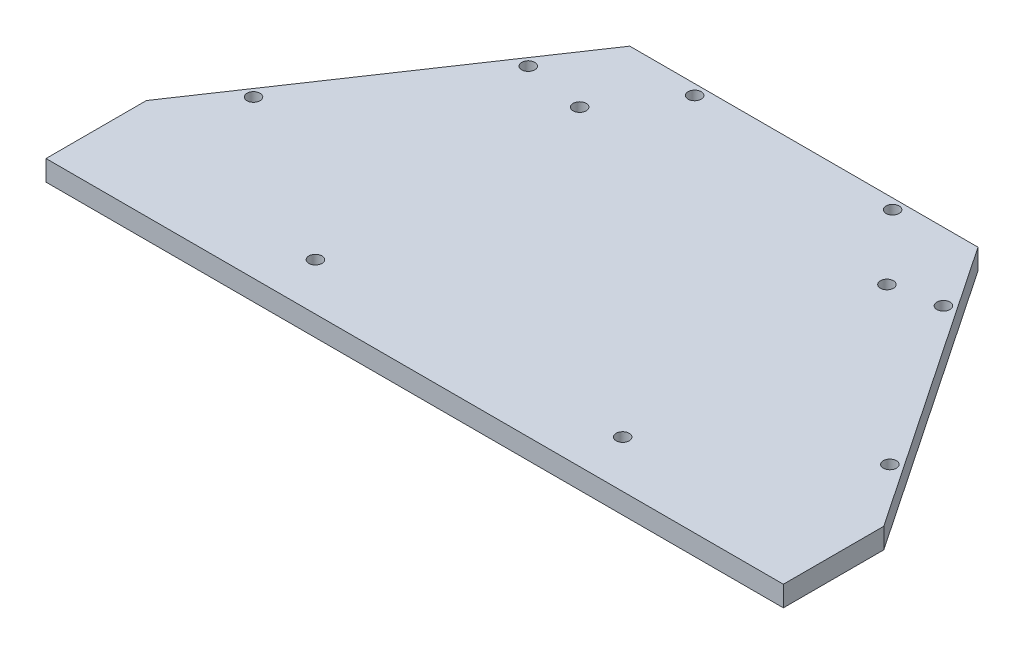
ISO-10303-21;
HEADER;
FILE_DESCRIPTION(('STEP AP214'),'2;1');
FILE_NAME('part.step','',(''),(''),'','','');
FILE_SCHEMA(('AUTOMOTIVE_DESIGN { 1 0 10303 214 1 1 1 1 }'));
ENDSEC;
DATA;
#1=APPLICATION_CONTEXT('core data for automotive mechanical design processes');
#2=APPLICATION_PROTOCOL_DEFINITION('international standard','automotive_design',2000,#1);
#3=PRODUCT_CONTEXT('',#1,'mechanical');
#4=PRODUCT('Part','Part','',(#3));
#5=PRODUCT_RELATED_PRODUCT_CATEGORY('part','',(#4));
#6=PRODUCT_DEFINITION_FORMATION('','',#4);
#7=PRODUCT_DEFINITION_CONTEXT('part definition',#1,'design');
#8=PRODUCT_DEFINITION('design','',#6,#7);
#9=PRODUCT_DEFINITION_SHAPE('','',#8);
#10=(LENGTH_UNIT() NAMED_UNIT(*) SI_UNIT(.MILLI.,.METRE.));
#11=(NAMED_UNIT(*) PLANE_ANGLE_UNIT() SI_UNIT($,.RADIAN.));
#12=(NAMED_UNIT(*) SI_UNIT($,.STERADIAN.) SOLID_ANGLE_UNIT());
#13=UNCERTAINTY_MEASURE_WITH_UNIT(LENGTH_MEASURE(1.E-05),#10,'distance_accuracy_value','');
#14=(GEOMETRIC_REPRESENTATION_CONTEXT(3) GLOBAL_UNCERTAINTY_ASSIGNED_CONTEXT((#13)) GLOBAL_UNIT_ASSIGNED_CONTEXT((#10,
#11,#12)) REPRESENTATION_CONTEXT('',''));
#15=CARTESIAN_POINT('',(0.,0.,0.));
#16=DIRECTION('',(0.,0.,1.));
#17=DIRECTION('',(1.,0.,0.));
#18=AXIS2_PLACEMENT_3D('',#15,#16,#17);
#19=CARTESIAN_POINT('',(41.5074305798119,-8.,-4.70896110099949));
#20=DIRECTION('',(0.,1.,0.));
#21=DIRECTION('',(0.,0.,1.));
#22=AXIS2_PLACEMENT_3D('',#19,#20,#21);
#23=CYLINDRICAL_SURFACE('',#22,1.60000000000001);
#24=CARTESIAN_POINT('',(41.5074305798119,5.,-4.70896110099949));
#25=DIRECTION('',(0.,1.,0.));
#26=DIRECTION('',(0.,0.,-1.));
#27=AXIS2_PLACEMENT_3D('',#24,#25,#26);
#28=CIRCLE('',#27,1.60000000000001);
#29=CARTESIAN_POINT('',(41.5074305798119,5.,-6.30896110099949));
#30=VERTEX_POINT('',#29);
#31=EDGE_CURVE('E203',#30,#30,#28,.T.);
#32=ORIENTED_EDGE('',*,*,#31,.T.);
#33=EDGE_LOOP('',(#32));
#34=FACE_BOUND('',#33,.T.);
#35=CARTESIAN_POINT('',(41.5074305798119,1.,-4.70896110099949));
#36=DIRECTION('',(0.,-1.,0.));
#37=DIRECTION('',(0.,0.,-1.));
#38=AXIS2_PLACEMENT_3D('',#35,#36,#37);
#39=CIRCLE('',#38,1.60000000000001);
#40=CARTESIAN_POINT('',(41.5074305798119,1.,-6.30896110099949));
#41=VERTEX_POINT('',#40);
#42=EDGE_CURVE('E42',#41,#41,#39,.F.);
#43=ORIENTED_EDGE('',*,*,#42,.F.);
#44=EDGE_LOOP('',(#43));
#45=FACE_BOUND('',#44,.T.);
#46=ADVANCED_FACE('F38',(#34,#45),#23,.F.);
#47=CARTESIAN_POINT('',(-33.4925694201881,-8.,-4.70896110099947));
#48=DIRECTION('',(0.,1.,0.));
#49=DIRECTION('',(0.,0.,1.));
#50=AXIS2_PLACEMENT_3D('',#47,#48,#49);
#51=CYLINDRICAL_SURFACE('',#50,1.60000000000001);
#52=CARTESIAN_POINT('',(-33.4925694201881,5.,-4.70896110099947));
#53=DIRECTION('',(0.,1.,0.));
#54=DIRECTION('',(0.,0.,1.));
#55=AXIS2_PLACEMENT_3D('',#52,#53,#54);
#56=CIRCLE('',#55,1.60000000000001);
#57=CARTESIAN_POINT('',(-33.4925694201881,5.,-3.10896110099946));
#58=VERTEX_POINT('',#57);
#59=EDGE_CURVE('E207',#58,#58,#56,.T.);
#60=ORIENTED_EDGE('',*,*,#59,.T.);
#61=EDGE_LOOP('',(#60));
#62=FACE_BOUND('',#61,.T.);
#63=CARTESIAN_POINT('',(-33.4925694201881,1.,-4.70896110099947));
#64=DIRECTION('',(0.,-1.,0.));
#65=DIRECTION('',(0.,0.,-1.));
#66=AXIS2_PLACEMENT_3D('',#63,#64,#65);
#67=CIRCLE('',#66,1.60000000000001);
#68=CARTESIAN_POINT('',(-33.4925694201881,1.,-6.30896110099947));
#69=VERTEX_POINT('',#68);
#70=EDGE_CURVE('E189',#69,#69,#67,.F.);
#71=ORIENTED_EDGE('',*,*,#70,.F.);
#72=EDGE_LOOP('',(#71));
#73=FACE_BOUND('',#72,.T.);
#74=ADVANCED_FACE('F282',(#62,#73),#51,.F.);
#75=CARTESIAN_POINT('',(41.5074305798119,-8.,59.7910388990005));
#76=DIRECTION('',(0.,1.,0.));
#77=DIRECTION('',(0.,0.,1.));
#78=AXIS2_PLACEMENT_3D('',#75,#76,#77);
#79=CYLINDRICAL_SURFACE('',#78,1.60000000000001);
#80=CARTESIAN_POINT('',(41.5074305798119,5.,59.7910388990005));
#81=DIRECTION('',(0.,1.,0.));
#82=DIRECTION('',(0.,0.,1.));
#83=AXIS2_PLACEMENT_3D('',#80,#81,#82);
#84=CIRCLE('',#83,1.60000000000001);
#85=CARTESIAN_POINT('',(41.5074305798119,5.,61.3910388990005));
#86=VERTEX_POINT('',#85);
#87=EDGE_CURVE('E197',#86,#86,#84,.T.);
#88=ORIENTED_EDGE('',*,*,#87,.T.);
#89=EDGE_LOOP('',(#88));
#90=FACE_BOUND('',#89,.T.);
#91=CARTESIAN_POINT('',(41.5074305798119,1.,59.7910388990005));
#92=DIRECTION('',(0.,-1.,0.));
#93=DIRECTION('',(0.,0.,-1.));
#94=AXIS2_PLACEMENT_3D('',#91,#92,#93);
#95=CIRCLE('',#94,1.60000000000001);
#96=CARTESIAN_POINT('',(41.5074305798119,1.,58.1910388990005));
#97=VERTEX_POINT('',#96);
#98=EDGE_CURVE('E185',#97,#97,#95,.F.);
#99=ORIENTED_EDGE('',*,*,#98,.F.);
#100=EDGE_LOOP('',(#99));
#101=FACE_BOUND('',#100,.T.);
#102=ADVANCED_FACE('F287',(#90,#101),#79,.F.);
#103=CARTESIAN_POINT('',(-33.4925694201881,-8.,59.7910388990005));
#104=DIRECTION('',(0.,1.,0.));
#105=DIRECTION('',(0.,0.,1.));
#106=AXIS2_PLACEMENT_3D('',#103,#104,#105);
#107=CYLINDRICAL_SURFACE('',#106,1.60000000000001);
#108=CARTESIAN_POINT('',(-33.4925694201881,5.,59.7910388990005));
#109=DIRECTION('',(0.,1.,0.));
#110=DIRECTION('',(0.,0.,-1.));
#111=AXIS2_PLACEMENT_3D('',#108,#109,#110);
#112=CIRCLE('',#111,1.60000000000001);
#113=CARTESIAN_POINT('',(-33.4925694201881,5.,58.1910388990005));
#114=VERTEX_POINT('',#113);
#115=EDGE_CURVE('E192',#114,#114,#112,.T.);
#116=ORIENTED_EDGE('',*,*,#115,.T.);
#117=EDGE_LOOP('',(#116));
#118=FACE_BOUND('',#117,.T.);
#119=CARTESIAN_POINT('',(-33.4925694201881,1.,59.7910388990005));
#120=DIRECTION('',(0.,-1.,0.));
#121=DIRECTION('',(0.,0.,-1.));
#122=AXIS2_PLACEMENT_3D('',#119,#120,#121);
#123=CIRCLE('',#122,1.60000000000001);
#124=CARTESIAN_POINT('',(-33.4925694201881,1.,58.1910388990005));
#125=VERTEX_POINT('',#124);
#126=EDGE_CURVE('E181',#125,#125,#123,.F.);
#127=ORIENTED_EDGE('',*,*,#126,.F.);
#128=EDGE_LOOP('',(#127));
#129=FACE_BOUND('',#128,.T.);
#130=ADVANCED_FACE('F296',(#118,#129),#107,.F.);
#131=CARTESIAN_POINT('',(-87.7612940741507,5.,71.2941102865789));
#132=DIRECTION('',(0.,0.,-1.));
#133=DIRECTION('',(-1.,0.,0.));
#134=AXIS2_PLACEMENT_3D('',#131,#132,#133);
#135=PLANE('',#134);
#136=DIRECTION('',(1.,0.,0.));
#137=VECTOR('',#136,1.);
#138=CARTESIAN_POINT('',(-87.7612940741507,0.,71.2941102865789));
#139=LINE('',#138,#137);
#140=CARTESIAN_POINT('',(-87.7612940741507,0.,71.2941102865789));
#141=VERTEX_POINT('',#140);
#142=CARTESIAN_POINT('',(92.2276923684008,0.,71.2941102865789));
#143=VERTEX_POINT('',#142);
#144=EDGE_CURVE('E130',#141,#143,#139,.T.);
#145=ORIENTED_EDGE('',*,*,#144,.T.);
#146=DIRECTION('',(0.,-1.,0.));
#147=VECTOR('',#146,1.);
#148=CARTESIAN_POINT('',(92.2276923684008,5.,71.2941102865789));
#149=LINE('',#148,#147);
#150=CARTESIAN_POINT('',(92.2276923684008,5.,71.2941102865789));
#151=VERTEX_POINT('',#150);
#152=EDGE_CURVE('E11',#151,#143,#149,.T.);
#153=ORIENTED_EDGE('',*,*,#152,.F.);
#154=DIRECTION('',(1.,0.,0.));
#155=VECTOR('',#154,1.);
#156=CARTESIAN_POINT('',(-87.7612940741507,5.,71.2941102865789));
#157=LINE('',#156,#155);
#158=CARTESIAN_POINT('',(-87.7612940741507,5.,71.2941102865789));
#159=VERTEX_POINT('',#158);
#160=EDGE_CURVE('E147',#159,#151,#157,.T.);
#161=ORIENTED_EDGE('',*,*,#160,.F.);
#162=DIRECTION('',(0.,-1.,0.));
#163=VECTOR('',#162,1.);
#164=CARTESIAN_POINT('',(-87.7612940741507,5.,71.2941102865789));
#165=LINE('',#164,#163);
#166=EDGE_CURVE('E126',#159,#141,#165,.T.);
#167=ORIENTED_EDGE('',*,*,#166,.T.);
#168=EDGE_LOOP('',(#145,#153,#161,#167));
#169=FACE_BOUND('',#168,.T.);
#170=ADVANCED_FACE('F40',(#169),#135,.F.);
#171=CARTESIAN_POINT('',(92.2276923684008,5.,46.7841102865785));
#172=DIRECTION('',(-1.,0.,0.));
#173=DIRECTION('',(0.,0.,1.));
#174=AXIS2_PLACEMENT_3D('',#171,#172,#173);
#175=PLANE('',#174);
#176=DIRECTION('',(0.,0.,-1.));
#177=VECTOR('',#176,1.);
#178=CARTESIAN_POINT('',(92.2276923684008,0.,46.7841102865785));
#179=LINE('',#178,#177);
#180=CARTESIAN_POINT('',(92.2276923684008,0.,46.7841102865785));
#181=VERTEX_POINT('',#180);
#182=EDGE_CURVE('E134',#143,#181,#179,.T.);
#183=ORIENTED_EDGE('',*,*,#182,.T.);
#184=DIRECTION('',(0.,-1.,0.));
#185=VECTOR('',#184,1.);
#186=CARTESIAN_POINT('',(92.2276923684008,5.,46.7841102865785));
#187=LINE('',#186,#185);
#188=CARTESIAN_POINT('',(92.2276923684008,5.,46.7841102865785));
#189=VERTEX_POINT('',#188);
#190=EDGE_CURVE('E49',#189,#181,#187,.T.);
#191=ORIENTED_EDGE('',*,*,#190,.F.);
#192=DIRECTION('',(0.,0.,-1.));
#193=VECTOR('',#192,1.);
#194=CARTESIAN_POINT('',(92.2276923684008,5.,46.7841102865785));
#195=LINE('',#194,#193);
#196=EDGE_CURVE('E95',#151,#189,#195,.T.);
#197=ORIENTED_EDGE('',*,*,#196,.F.);
#198=ORIENTED_EDGE('',*,*,#152,.T.);
#199=EDGE_LOOP('',(#183,#191,#197,#198));
#200=FACE_BOUND('',#199,.T.);
#201=ADVANCED_FACE('F341',(#200),#175,.F.);
#202=CARTESIAN_POINT('',(44.7331991471248,5.,-23.7089611009995));
#203=DIRECTION('',(-0.829330251618565,0.,0.558758743779717));
#204=DIRECTION('',(0.558758743779717,0.,0.829330251618565));
#205=AXIS2_PLACEMENT_3D('',#202,#203,#204);
#206=PLANE('',#205);
#207=DIRECTION('',(-0.558758743779717,0.,-0.829330251618565));
#208=VECTOR('',#207,1.);
#209=CARTESIAN_POINT('',(44.7331991471248,0.,-23.7089611009995));
#210=LINE('',#209,#208);
#211=CARTESIAN_POINT('',(44.7331991471248,0.,-23.7089611009995));
#212=VERTEX_POINT('',#211);
#213=EDGE_CURVE('E138',#181,#212,#210,.T.);
#214=ORIENTED_EDGE('',*,*,#213,.T.);
#215=DIRECTION('',(0.,-1.,0.));
#216=VECTOR('',#215,1.);
#217=CARTESIAN_POINT('',(44.7331991471248,5.,-23.7089611009995));
#218=LINE('',#217,#216);
#219=CARTESIAN_POINT('',(44.7331991471248,5.,-23.7089611009995));
#220=VERTEX_POINT('',#219);
#221=EDGE_CURVE('E119',#220,#212,#218,.T.);
#222=ORIENTED_EDGE('',*,*,#221,.F.);
#223=DIRECTION('',(-0.558758743779717,0.,-0.829330251618565));
#224=VECTOR('',#223,1.);
#225=CARTESIAN_POINT('',(44.7331991471248,5.,-23.7089611009995));
#226=LINE('',#225,#224);
#227=EDGE_CURVE('E108',#189,#220,#226,.T.);
#228=ORIENTED_EDGE('',*,*,#227,.F.);
#229=ORIENTED_EDGE('',*,*,#190,.T.);
#230=EDGE_LOOP('',(#214,#222,#228,#229));
#231=FACE_BOUND('',#230,.T.);
#232=ADVANCED_FACE('F339',(#231),#206,.F.);
#233=CARTESIAN_POINT('',(44.7331991471248,5.,-23.7089611009995));
#234=DIRECTION('',(0.,0.,1.));
#235=DIRECTION('',(1.,0.,0.));
#236=AXIS2_PLACEMENT_3D('',#233,#234,#235);
#237=PLANE('',#236);
#238=DIRECTION('',(-1.,0.,0.));
#239=VECTOR('',#238,1.);
#240=CARTESIAN_POINT('',(44.7331991471248,0.,-23.7089611009995));
#241=LINE('',#240,#239);
#242=CARTESIAN_POINT('',(-40.2668008528752,0.,-23.7089611009995));
#243=VERTEX_POINT('',#242);
#244=EDGE_CURVE('E117',#212,#243,#241,.T.);
#245=ORIENTED_EDGE('',*,*,#244,.T.);
#246=DIRECTION('',(0.,-1.,0.));
#247=VECTOR('',#246,1.);
#248=CARTESIAN_POINT('',(-40.2668008528752,5.,-23.7089611009995));
#249=LINE('',#248,#247);
#250=CARTESIAN_POINT('',(-40.2668008528752,5.,-23.7089611009995));
#251=VERTEX_POINT('',#250);
#252=EDGE_CURVE('E114',#251,#243,#249,.T.);
#253=ORIENTED_EDGE('',*,*,#252,.F.);
#254=DIRECTION('',(-1.,0.,0.));
#255=VECTOR('',#254,1.);
#256=CARTESIAN_POINT('',(44.7331991471248,5.,-23.7089611009995));
#257=LINE('',#256,#255);
#258=EDGE_CURVE('E102',#220,#251,#257,.T.);
#259=ORIENTED_EDGE('',*,*,#258,.F.);
#260=ORIENTED_EDGE('',*,*,#221,.T.);
#261=EDGE_LOOP('',(#245,#253,#259,#260));
#262=FACE_BOUND('',#261,.T.);
#263=ADVANCED_FACE('F115',(#262),#237,.F.);
#264=CARTESIAN_POINT('',(-40.2668008528752,5.,-23.7089611009995));
#265=DIRECTION('',(0.829330251618569,0.,0.558758743779711));
#266=DIRECTION('',(0.558758743779711,0.,-0.829330251618569));
#267=AXIS2_PLACEMENT_3D('',#264,#265,#266);
#268=PLANE('',#267);
#269=DIRECTION('',(-0.558758743779711,0.,0.829330251618569));
#270=VECTOR('',#269,1.);
#271=CARTESIAN_POINT('',(-40.2668008528752,0.,-23.7089611009995));
#272=LINE('',#271,#270);
#273=CARTESIAN_POINT('',(-87.7612940741507,0.,46.7841102865789));
#274=VERTEX_POINT('',#273);
#275=EDGE_CURVE('E81',#243,#274,#272,.T.);
#276=ORIENTED_EDGE('',*,*,#275,.T.);
#277=DIRECTION('',(0.,-1.,0.));
#278=VECTOR('',#277,1.);
#279=CARTESIAN_POINT('',(-87.7612940741507,5.,46.7841102865789));
#280=LINE('',#279,#278);
#281=CARTESIAN_POINT('',(-87.7612940741507,5.,46.7841102865789));
#282=VERTEX_POINT('',#281);
#283=EDGE_CURVE('E120',#282,#274,#280,.T.);
#284=ORIENTED_EDGE('',*,*,#283,.F.);
#285=DIRECTION('',(-0.558758743779711,0.,0.829330251618569));
#286=VECTOR('',#285,1.);
#287=CARTESIAN_POINT('',(-40.2668008528752,5.,-23.7089611009995));
#288=LINE('',#287,#286);
#289=EDGE_CURVE('E106',#251,#282,#288,.T.);
#290=ORIENTED_EDGE('',*,*,#289,.F.);
#291=ORIENTED_EDGE('',*,*,#252,.T.);
#292=EDGE_LOOP('',(#276,#284,#290,#291));
#293=FACE_BOUND('',#292,.T.);
#294=ADVANCED_FACE('F122',(#293),#268,.F.);
#295=CARTESIAN_POINT('',(-87.7612940741507,5.,46.7841102865789));
#296=DIRECTION('',(1.,0.,0.));
#297=DIRECTION('',(0.,0.,-1.));
#298=AXIS2_PLACEMENT_3D('',#295,#296,#297);
#299=PLANE('',#298);
#300=DIRECTION('',(0.,0.,1.));
#301=VECTOR('',#300,1.);
#302=CARTESIAN_POINT('',(-87.7612940741507,0.,46.7841102865789));
#303=LINE('',#302,#301);
#304=EDGE_CURVE('E87',#274,#141,#303,.T.);
#305=ORIENTED_EDGE('',*,*,#304,.T.);
#306=ORIENTED_EDGE('',*,*,#166,.F.);
#307=DIRECTION('',(0.,0.,1.));
#308=VECTOR('',#307,1.);
#309=CARTESIAN_POINT('',(-87.7612940741507,5.,46.7841102865789));
#310=LINE('',#309,#308);
#311=EDGE_CURVE('E58',#282,#159,#310,.T.);
#312=ORIENTED_EDGE('',*,*,#311,.F.);
#313=ORIENTED_EDGE('',*,*,#283,.T.);
#314=EDGE_LOOP('',(#305,#306,#312,#313));
#315=FACE_BOUND('',#314,.T.);
#316=ADVANCED_FACE('F328',(#315),#299,.F.);
#317=CARTESIAN_POINT('',(0.,5.,0.));
#318=DIRECTION('',(0.,-1.,0.));
#319=DIRECTION('',(0.,0.,-1.));
#320=AXIS2_PLACEMENT_3D('',#317,#318,#319);
#321=PLANE('',#320);
#322=ORIENTED_EDGE('',*,*,#115,.F.);
#323=EDGE_LOOP('',(#322));
#324=FACE_BOUND('',#323,.T.);
#325=ORIENTED_EDGE('',*,*,#87,.F.);
#326=EDGE_LOOP('',(#325));
#327=FACE_BOUND('',#326,.T.);
#328=ORIENTED_EDGE('',*,*,#31,.F.);
#329=EDGE_LOOP('',(#328));
#330=FACE_BOUND('',#329,.T.);
#331=ORIENTED_EDGE('',*,*,#59,.F.);
#332=EDGE_LOOP('',(#331));
#333=FACE_BOUND('',#332,.T.);
#334=CARTESIAN_POINT('',(79.9045846010377,5.,32.9679040054775));
#335=DIRECTION('',(0.,1.,0.));
#336=DIRECTION('',(0.,0.,1.));
#337=AXIS2_PLACEMENT_3D('',#334,#335,#336);
#338=CIRCLE('',#337,1.6);
#339=CARTESIAN_POINT('',(79.9045846010377,5.,34.5679040054775));
#340=VERTEX_POINT('',#339);
#341=EDGE_CURVE('E211',#340,#340,#338,.T.);
#342=ORIENTED_EDGE('',*,*,#341,.F.);
#343=EDGE_LOOP('',(#342));
#344=FACE_BOUND('',#343,.T.);
#345=CARTESIAN_POINT('',(26.3938829455287,5.,-21.2089611009995));
#346=DIRECTION('',(0.,1.,0.));
#347=DIRECTION('',(0.,0.,-1.));
#348=AXIS2_PLACEMENT_3D('',#345,#346,#347);
#349=CIRCLE('',#348,1.6);
#350=CARTESIAN_POINT('',(26.3938829455287,5.,-22.8089611009995));
#351=VERTEX_POINT('',#350);
#352=EDGE_CURVE('E221',#351,#351,#349,.T.);
#353=ORIENTED_EDGE('',*,*,#352,.F.);
#354=EDGE_LOOP('',(#353));
#355=FACE_BOUND('',#354,.T.);
#356=CARTESIAN_POINT('',(-48.443257362145,5.,-7.09896110099945));
#357=DIRECTION('',(0.,1.,0.));
#358=DIRECTION('',(0.,0.,1.));
#359=AXIS2_PLACEMENT_3D('',#356,#357,#358);
#360=CIRCLE('',#359,1.6);
#361=CARTESIAN_POINT('',(-48.443257362145,5.,-5.49896110099945));
#362=VERTEX_POINT('',#361);
#363=EDGE_CURVE('E216',#362,#362,#360,.T.);
#364=ORIENTED_EDGE('',*,*,#363,.F.);
#365=EDGE_LOOP('',(#364));
#366=FACE_BOUND('',#365,.T.);
#367=CARTESIAN_POINT('',(-75.438186306788,5.,32.9679040054775));
#368=DIRECTION('',(0.,1.,0.));
#369=DIRECTION('',(0.,0.,-1.));
#370=AXIS2_PLACEMENT_3D('',#367,#368,#369);
#371=CIRCLE('',#370,1.6);
#372=CARTESIAN_POINT('',(-75.438186306788,5.,31.3679040054775));
#373=VERTEX_POINT('',#372);
#374=EDGE_CURVE('E212',#373,#373,#371,.T.);
#375=ORIENTED_EDGE('',*,*,#374,.F.);
#376=EDGE_LOOP('',(#375));
#377=FACE_BOUND('',#376,.T.);
#378=CARTESIAN_POINT('',(52.9096556563946,5.,-7.09896110099945));
#379=DIRECTION('',(0.,1.,0.));
#380=DIRECTION('',(0.,0.,-1.));
#381=AXIS2_PLACEMENT_3D('',#378,#379,#380);
#382=CIRCLE('',#381,1.6);
#383=CARTESIAN_POINT('',(52.9096556563946,5.,-8.69896110099945));
#384=VERTEX_POINT('',#383);
#385=EDGE_CURVE('E217',#384,#384,#382,.T.);
#386=ORIENTED_EDGE('',*,*,#385,.F.);
#387=EDGE_LOOP('',(#386));
#388=FACE_BOUND('',#387,.T.);
#389=CARTESIAN_POINT('',(-21.9274846512791,5.,-21.2089611009995));
#390=DIRECTION('',(0.,1.,0.));
#391=DIRECTION('',(0.,0.,1.));
#392=AXIS2_PLACEMENT_3D('',#389,#390,#391);
#393=CIRCLE('',#392,1.6);
#394=CARTESIAN_POINT('',(-21.9274846512791,5.,-19.6089611009995));
#395=VERTEX_POINT('',#394);
#396=EDGE_CURVE('E162',#395,#395,#393,.T.);
#397=ORIENTED_EDGE('',*,*,#396,.F.);
#398=EDGE_LOOP('',(#397));
#399=FACE_BOUND('',#398,.T.);
#400=ORIENTED_EDGE('',*,*,#160,.T.);
#401=ORIENTED_EDGE('',*,*,#196,.T.);
#402=ORIENTED_EDGE('',*,*,#227,.T.);
#403=ORIENTED_EDGE('',*,*,#258,.T.);
#404=ORIENTED_EDGE('',*,*,#289,.T.);
#405=ORIENTED_EDGE('',*,*,#311,.T.);
#406=EDGE_LOOP('',(#400,#401,#402,#403,#404,#405));
#407=FACE_BOUND('',#406,.T.);
#408=ADVANCED_FACE('F104',(#324,#327,#330,#333,#344,#355,#366,#377,#388,#399,#407),#321,.F.);
#409=CARTESIAN_POINT('',(0.,0.,0.));
#410=DIRECTION('',(0.,-1.,0.));
#411=DIRECTION('',(0.,0.,-1.));
#412=AXIS2_PLACEMENT_3D('',#409,#410,#411);
#413=PLANE('',#412);
#414=CARTESIAN_POINT('',(41.5074305798119,0.,-4.70896110099949));
#415=DIRECTION('',(0.,-1.,0.));
#416=DIRECTION('',(0.,0.,-1.));
#417=AXIS2_PLACEMENT_3D('',#414,#415,#416);
#418=CIRCLE('',#417,2.8);
#419=CARTESIAN_POINT('',(41.5074305798119,0.,-7.50896110099948));
#420=VERTEX_POINT('',#419);
#421=EDGE_CURVE('E266',#420,#420,#418,.T.);
#422=ORIENTED_EDGE('',*,*,#421,.F.);
#423=EDGE_LOOP('',(#422));
#424=FACE_BOUND('',#423,.T.);
#425=CARTESIAN_POINT('',(-33.4925694201881,0.,-4.70896110099947));
#426=DIRECTION('',(0.,-1.,0.));
#427=DIRECTION('',(0.,0.,-1.));
#428=AXIS2_PLACEMENT_3D('',#425,#426,#427);
#429=CIRCLE('',#428,2.8);
#430=CARTESIAN_POINT('',(-33.4925694201881,0.,-7.50896110099947));
#431=VERTEX_POINT('',#430);
#432=EDGE_CURVE('E259',#431,#431,#429,.T.);
#433=ORIENTED_EDGE('',*,*,#432,.F.);
#434=EDGE_LOOP('',(#433));
#435=FACE_BOUND('',#434,.T.);
#436=CARTESIAN_POINT('',(-33.4925694201881,0.,59.7910388990005));
#437=DIRECTION('',(0.,-1.,0.));
#438=DIRECTION('',(0.,0.,-1.));
#439=AXIS2_PLACEMENT_3D('',#436,#437,#438);
#440=CIRCLE('',#439,2.8);
#441=CARTESIAN_POINT('',(-33.4925694201881,0.,56.9910388990005));
#442=VERTEX_POINT('',#441);
#443=EDGE_CURVE('E251',#442,#442,#440,.T.);
#444=ORIENTED_EDGE('',*,*,#443,.F.);
#445=EDGE_LOOP('',(#444));
#446=FACE_BOUND('',#445,.T.);
#447=CARTESIAN_POINT('',(41.5074305798119,0.,59.7910388990005));
#448=DIRECTION('',(0.,-1.,0.));
#449=DIRECTION('',(0.,0.,-1.));
#450=AXIS2_PLACEMENT_3D('',#447,#448,#449);
#451=CIRCLE('',#450,2.8);
#452=CARTESIAN_POINT('',(41.5074305798119,0.,56.9910388990005));
#453=VERTEX_POINT('',#452);
#454=EDGE_CURVE('E243',#453,#453,#451,.T.);
#455=ORIENTED_EDGE('',*,*,#454,.F.);
#456=EDGE_LOOP('',(#455));
#457=FACE_BOUND('',#456,.T.);
#458=CARTESIAN_POINT('',(79.9045846010377,0.,32.9679040054775));
#459=DIRECTION('',(0.,-1.,0.));
#460=DIRECTION('',(0.,0.,-1.));
#461=AXIS2_PLACEMENT_3D('',#458,#459,#460);
#462=CIRCLE('',#461,1.6);
#463=CARTESIAN_POINT('',(79.9045846010377,0.,31.3679040054775));
#464=VERTEX_POINT('',#463);
#465=EDGE_CURVE('E135',#464,#464,#462,.T.);
#466=ORIENTED_EDGE('',*,*,#465,.F.);
#467=EDGE_LOOP('',(#466));
#468=FACE_BOUND('',#467,.T.);
#469=CARTESIAN_POINT('',(26.3938829455287,0.,-21.2089611009995));
#470=DIRECTION('',(0.,-1.,0.));
#471=DIRECTION('',(0.,0.,-1.));
#472=AXIS2_PLACEMENT_3D('',#469,#470,#471);
#473=CIRCLE('',#472,1.6);
#474=CARTESIAN_POINT('',(26.3938829455287,0.,-22.8089611009995));
#475=VERTEX_POINT('',#474);
#476=EDGE_CURVE('E174',#475,#475,#473,.T.);
#477=ORIENTED_EDGE('',*,*,#476,.F.);
#478=EDGE_LOOP('',(#477));
#479=FACE_BOUND('',#478,.T.);
#480=CARTESIAN_POINT('',(-48.443257362145,0.,-7.09896110099945));
#481=DIRECTION('',(0.,-1.,0.));
#482=DIRECTION('',(0.,0.,-1.));
#483=AXIS2_PLACEMENT_3D('',#480,#481,#482);
#484=CIRCLE('',#483,1.6);
#485=CARTESIAN_POINT('',(-48.443257362145,0.,-8.69896110099945));
#486=VERTEX_POINT('',#485);
#487=EDGE_CURVE('E170',#486,#486,#484,.T.);
#488=ORIENTED_EDGE('',*,*,#487,.F.);
#489=EDGE_LOOP('',(#488));
#490=FACE_BOUND('',#489,.T.);
#491=CARTESIAN_POINT('',(-75.438186306788,0.,32.9679040054775));
#492=DIRECTION('',(0.,-1.,0.));
#493=DIRECTION('',(0.,0.,-1.));
#494=AXIS2_PLACEMENT_3D('',#491,#492,#493);
#495=CIRCLE('',#494,1.6);
#496=CARTESIAN_POINT('',(-75.438186306788,0.,31.3679040054775));
#497=VERTEX_POINT('',#496);
#498=EDGE_CURVE('E166',#497,#497,#495,.T.);
#499=ORIENTED_EDGE('',*,*,#498,.F.);
#500=EDGE_LOOP('',(#499));
#501=FACE_BOUND('',#500,.T.);
#502=CARTESIAN_POINT('',(52.9096556563946,0.,-7.09896110099945));
#503=DIRECTION('',(0.,-1.,0.));
#504=DIRECTION('',(0.,0.,-1.));
#505=AXIS2_PLACEMENT_3D('',#502,#503,#504);
#506=CIRCLE('',#505,1.6);
#507=CARTESIAN_POINT('',(52.9096556563946,0.,-8.69896110099945));
#508=VERTEX_POINT('',#507);
#509=EDGE_CURVE('E161',#508,#508,#506,.T.);
#510=ORIENTED_EDGE('',*,*,#509,.F.);
#511=EDGE_LOOP('',(#510));
#512=FACE_BOUND('',#511,.T.);
#513=CARTESIAN_POINT('',(-21.9274846512791,0.,-21.2089611009995));
#514=DIRECTION('',(0.,-1.,0.));
#515=DIRECTION('',(0.,0.,-1.));
#516=AXIS2_PLACEMENT_3D('',#513,#514,#515);
#517=CIRCLE('',#516,1.6);
#518=CARTESIAN_POINT('',(-21.9274846512791,0.,-22.8089611009995));
#519=VERTEX_POINT('',#518);
#520=EDGE_CURVE('E157',#519,#519,#517,.T.);
#521=ORIENTED_EDGE('',*,*,#520,.F.);
#522=EDGE_LOOP('',(#521));
#523=FACE_BOUND('',#522,.T.);
#524=ORIENTED_EDGE('',*,*,#144,.F.);
#525=ORIENTED_EDGE('',*,*,#304,.F.);
#526=ORIENTED_EDGE('',*,*,#275,.F.);
#527=ORIENTED_EDGE('',*,*,#244,.F.);
#528=ORIENTED_EDGE('',*,*,#213,.F.);
#529=ORIENTED_EDGE('',*,*,#182,.F.);
#530=EDGE_LOOP('',(#524,#525,#526,#527,#528,#529));
#531=FACE_BOUND('',#530,.T.);
#532=ADVANCED_FACE('F324',(#424,#435,#446,#457,#468,#479,#490,#501,#512,#523,#531),#413,.T.);
#533=CARTESIAN_POINT('',(-21.9274846512791,-5.,-21.2089611009995));
#534=DIRECTION('',(0.,1.,0.));
#535=DIRECTION('',(0.,0.,1.));
#536=AXIS2_PLACEMENT_3D('',#533,#534,#535);
#537=CYLINDRICAL_SURFACE('',#536,1.6);
#538=ORIENTED_EDGE('',*,*,#520,.T.);
#539=EDGE_LOOP('',(#538));
#540=FACE_BOUND('',#539,.T.);
#541=ORIENTED_EDGE('',*,*,#396,.T.);
#542=EDGE_LOOP('',(#541));
#543=FACE_BOUND('',#542,.T.);
#544=ADVANCED_FACE('F308',(#540,#543),#537,.F.);
#545=CARTESIAN_POINT('',(52.9096556563946,-5.,-7.09896110099945));
#546=DIRECTION('',(0.,1.,0.));
#547=DIRECTION('',(0.,0.,1.));
#548=AXIS2_PLACEMENT_3D('',#545,#546,#547);
#549=CYLINDRICAL_SURFACE('',#548,1.6);
#550=ORIENTED_EDGE('',*,*,#509,.T.);
#551=EDGE_LOOP('',(#550));
#552=FACE_BOUND('',#551,.T.);
#553=ORIENTED_EDGE('',*,*,#385,.T.);
#554=EDGE_LOOP('',(#553));
#555=FACE_BOUND('',#554,.T.);
#556=ADVANCED_FACE('F304',(#552,#555),#549,.F.);
#557=CARTESIAN_POINT('',(-75.438186306788,-5.,32.9679040054775));
#558=DIRECTION('',(0.,1.,0.));
#559=DIRECTION('',(0.,0.,1.));
#560=AXIS2_PLACEMENT_3D('',#557,#558,#559);
#561=CYLINDRICAL_SURFACE('',#560,1.6);
#562=ORIENTED_EDGE('',*,*,#498,.T.);
#563=EDGE_LOOP('',(#562));
#564=FACE_BOUND('',#563,.T.);
#565=ORIENTED_EDGE('',*,*,#374,.T.);
#566=EDGE_LOOP('',(#565));
#567=FACE_BOUND('',#566,.T.);
#568=ADVANCED_FACE('F300',(#564,#567),#561,.F.);
#569=CARTESIAN_POINT('',(-48.443257362145,-5.,-7.09896110099945));
#570=DIRECTION('',(0.,1.,0.));
#571=DIRECTION('',(0.,0.,1.));
#572=AXIS2_PLACEMENT_3D('',#569,#570,#571);
#573=CYLINDRICAL_SURFACE('',#572,1.6);
#574=ORIENTED_EDGE('',*,*,#487,.T.);
#575=EDGE_LOOP('',(#574));
#576=FACE_BOUND('',#575,.T.);
#577=ORIENTED_EDGE('',*,*,#363,.T.);
#578=EDGE_LOOP('',(#577));
#579=FACE_BOUND('',#578,.T.);
#580=ADVANCED_FACE('F303',(#576,#579),#573,.F.);
#581=CARTESIAN_POINT('',(26.3938829455287,-5.,-21.2089611009995));
#582=DIRECTION('',(0.,1.,0.));
#583=DIRECTION('',(0.,0.,1.));
#584=AXIS2_PLACEMENT_3D('',#581,#582,#583);
#585=CYLINDRICAL_SURFACE('',#584,1.6);
#586=ORIENTED_EDGE('',*,*,#476,.T.);
#587=EDGE_LOOP('',(#586));
#588=FACE_BOUND('',#587,.T.);
#589=ORIENTED_EDGE('',*,*,#352,.T.);
#590=EDGE_LOOP('',(#589));
#591=FACE_BOUND('',#590,.T.);
#592=ADVANCED_FACE('F310',(#588,#591),#585,.F.);
#593=CARTESIAN_POINT('',(79.9045846010377,-5.,32.9679040054775));
#594=DIRECTION('',(0.,1.,0.));
#595=DIRECTION('',(0.,0.,1.));
#596=AXIS2_PLACEMENT_3D('',#593,#594,#595);
#597=CYLINDRICAL_SURFACE('',#596,1.6);
#598=ORIENTED_EDGE('',*,*,#465,.T.);
#599=EDGE_LOOP('',(#598));
#600=FACE_BOUND('',#599,.T.);
#601=ORIENTED_EDGE('',*,*,#341,.T.);
#602=EDGE_LOOP('',(#601));
#603=FACE_BOUND('',#602,.T.);
#604=ADVANCED_FACE('F313',(#600,#603),#597,.F.);
#605=CARTESIAN_POINT('',(-33.4925694201881,1.,59.7910388990005));
#606=DIRECTION('',(0.,-1.,0.));
#607=DIRECTION('',(0.,0.,-1.));
#608=AXIS2_PLACEMENT_3D('',#605,#606,#607);
#609=PLANE('',#608);
#610=CARTESIAN_POINT('',(-33.4925694201881,1.,59.7910388990005));
#611=DIRECTION('',(0.,-1.,0.));
#612=DIRECTION('',(0.,0.,-1.));
#613=AXIS2_PLACEMENT_3D('',#610,#611,#612);
#614=CIRCLE('',#613,2.8);
#615=CARTESIAN_POINT('',(-33.4925694201881,1.,56.9910388990005));
#616=VERTEX_POINT('',#615);
#617=EDGE_CURVE('E255',#616,#616,#614,.T.);
#618=ORIENTED_EDGE('',*,*,#617,.T.);
#619=EDGE_LOOP('',(#618));
#620=FACE_BOUND('',#619,.T.);
#621=ORIENTED_EDGE('',*,*,#126,.T.);
#622=EDGE_LOOP('',(#621));
#623=FACE_BOUND('',#622,.T.);
#624=ADVANCED_FACE('F320',(#620,#623),#609,.T.);
#625=CARTESIAN_POINT('',(-33.4925694201881,1.,59.7910388990005));
#626=DIRECTION('',(0.,-1.,0.));
#627=DIRECTION('',(0.,0.,-1.));
#628=AXIS2_PLACEMENT_3D('',#625,#626,#627);
#629=CYLINDRICAL_SURFACE('',#628,2.8);
#630=ORIENTED_EDGE('',*,*,#617,.F.);
#631=EDGE_LOOP('',(#630));
#632=FACE_BOUND('',#631,.T.);
#633=ORIENTED_EDGE('',*,*,#443,.T.);
#634=EDGE_LOOP('',(#633));
#635=FACE_BOUND('',#634,.T.);
#636=ADVANCED_FACE('F484',(#632,#635),#629,.F.);
#637=CARTESIAN_POINT('',(41.5074305798119,1.,59.7910388990005));
#638=DIRECTION('',(0.,-1.,0.));
#639=DIRECTION('',(0.,0.,-1.));
#640=AXIS2_PLACEMENT_3D('',#637,#638,#639);
#641=PLANE('',#640);
#642=CARTESIAN_POINT('',(41.5074305798119,1.,59.7910388990005));
#643=DIRECTION('',(0.,-1.,0.));
#644=DIRECTION('',(0.,0.,-1.));
#645=AXIS2_PLACEMENT_3D('',#642,#643,#644);
#646=CIRCLE('',#645,2.8);
#647=CARTESIAN_POINT('',(41.5074305798119,1.,56.9910388990005));
#648=VERTEX_POINT('',#647);
#649=EDGE_CURVE('E247',#648,#648,#646,.T.);
#650=ORIENTED_EDGE('',*,*,#649,.T.);
#651=EDGE_LOOP('',(#650));
#652=FACE_BOUND('',#651,.T.);
#653=ORIENTED_EDGE('',*,*,#98,.T.);
#654=EDGE_LOOP('',(#653));
#655=FACE_BOUND('',#654,.T.);
#656=ADVANCED_FACE('F487',(#652,#655),#641,.T.);
#657=CARTESIAN_POINT('',(41.5074305798119,1.,59.7910388990005));
#658=DIRECTION('',(0.,-1.,0.));
#659=DIRECTION('',(0.,0.,-1.));
#660=AXIS2_PLACEMENT_3D('',#657,#658,#659);
#661=CYLINDRICAL_SURFACE('',#660,2.8);
#662=ORIENTED_EDGE('',*,*,#649,.F.);
#663=EDGE_LOOP('',(#662));
#664=FACE_BOUND('',#663,.T.);
#665=ORIENTED_EDGE('',*,*,#454,.T.);
#666=EDGE_LOOP('',(#665));
#667=FACE_BOUND('',#666,.T.);
#668=ADVANCED_FACE('F292',(#664,#667),#661,.F.);
#669=CARTESIAN_POINT('',(-33.4925694201881,1.,-4.70896110099947));
#670=DIRECTION('',(0.,-1.,0.));
#671=DIRECTION('',(0.,0.,-1.));
#672=AXIS2_PLACEMENT_3D('',#669,#670,#671);
#673=PLANE('',#672);
#674=CARTESIAN_POINT('',(-33.4925694201881,1.,-4.70896110099947));
#675=DIRECTION('',(0.,-1.,0.));
#676=DIRECTION('',(0.,0.,-1.));
#677=AXIS2_PLACEMENT_3D('',#674,#675,#676);
#678=CIRCLE('',#677,2.8);
#679=CARTESIAN_POINT('',(-33.4925694201881,1.,-7.50896110099947));
#680=VERTEX_POINT('',#679);
#681=EDGE_CURVE('E186',#680,#680,#678,.T.);
#682=ORIENTED_EDGE('',*,*,#681,.T.);
#683=EDGE_LOOP('',(#682));
#684=FACE_BOUND('',#683,.T.);
#685=ORIENTED_EDGE('',*,*,#70,.T.);
#686=EDGE_LOOP('',(#685));
#687=FACE_BOUND('',#686,.T.);
#688=ADVANCED_FACE('F477',(#684,#687),#673,.T.);
#689=CARTESIAN_POINT('',(-33.4925694201881,1.,-4.70896110099947));
#690=DIRECTION('',(0.,-1.,0.));
#691=DIRECTION('',(0.,0.,-1.));
#692=AXIS2_PLACEMENT_3D('',#689,#690,#691);
#693=CYLINDRICAL_SURFACE('',#692,2.8);
#694=ORIENTED_EDGE('',*,*,#681,.F.);
#695=EDGE_LOOP('',(#694));
#696=FACE_BOUND('',#695,.T.);
#697=ORIENTED_EDGE('',*,*,#432,.T.);
#698=EDGE_LOOP('',(#697));
#699=FACE_BOUND('',#698,.T.);
#700=ADVANCED_FACE('F461',(#696,#699),#693,.F.);
#701=CARTESIAN_POINT('',(41.5074305798119,1.,-4.70896110099949));
#702=DIRECTION('',(0.,-1.,0.));
#703=DIRECTION('',(0.,0.,-1.));
#704=AXIS2_PLACEMENT_3D('',#701,#702,#703);
#705=PLANE('',#704);
#706=CARTESIAN_POINT('',(41.5074305798119,1.,-4.70896110099949));
#707=DIRECTION('',(0.,-1.,0.));
#708=DIRECTION('',(0.,0.,-1.));
#709=AXIS2_PLACEMENT_3D('',#706,#707,#708);
#710=CIRCLE('',#709,2.8);
#711=CARTESIAN_POINT('',(41.5074305798119,1.,-7.50896110099948));
#712=VERTEX_POINT('',#711);
#713=EDGE_CURVE('E270',#712,#712,#710,.T.);
#714=ORIENTED_EDGE('',*,*,#713,.T.);
#715=EDGE_LOOP('',(#714));
#716=FACE_BOUND('',#715,.T.);
#717=ORIENTED_EDGE('',*,*,#42,.T.);
#718=EDGE_LOOP('',(#717));
#719=FACE_BOUND('',#718,.T.);
#720=ADVANCED_FACE('F279',(#716,#719),#705,.T.);
#721=CARTESIAN_POINT('',(41.5074305798119,1.,-4.70896110099949));
#722=DIRECTION('',(0.,-1.,0.));
#723=DIRECTION('',(0.,0.,-1.));
#724=AXIS2_PLACEMENT_3D('',#721,#722,#723);
#725=CYLINDRICAL_SURFACE('',#724,2.8);
#726=ORIENTED_EDGE('',*,*,#713,.F.);
#727=EDGE_LOOP('',(#726));
#728=FACE_BOUND('',#727,.T.);
#729=ORIENTED_EDGE('',*,*,#421,.T.);
#730=EDGE_LOOP('',(#729));
#731=FACE_BOUND('',#730,.T.);
#732=ADVANCED_FACE('F460',(#728,#731),#725,.F.);
#733=CLOSED_SHELL('',(#46,#74,#102,#130,#170,#201,#232,#263,#294,#316,#408,#532,#544,#556,#568,
#580,#592,#604,#624,#636,#656,#668,#688,#700,#720,#732));
#734=MANIFOLD_SOLID_BREP('B2',#733);
#735=ADVANCED_BREP_SHAPE_REPRESENTATION('',(#18,#734),#14);
#736=SHAPE_DEFINITION_REPRESENTATION(#9,#735);
ENDSEC;
END-ISO-10303-21;
